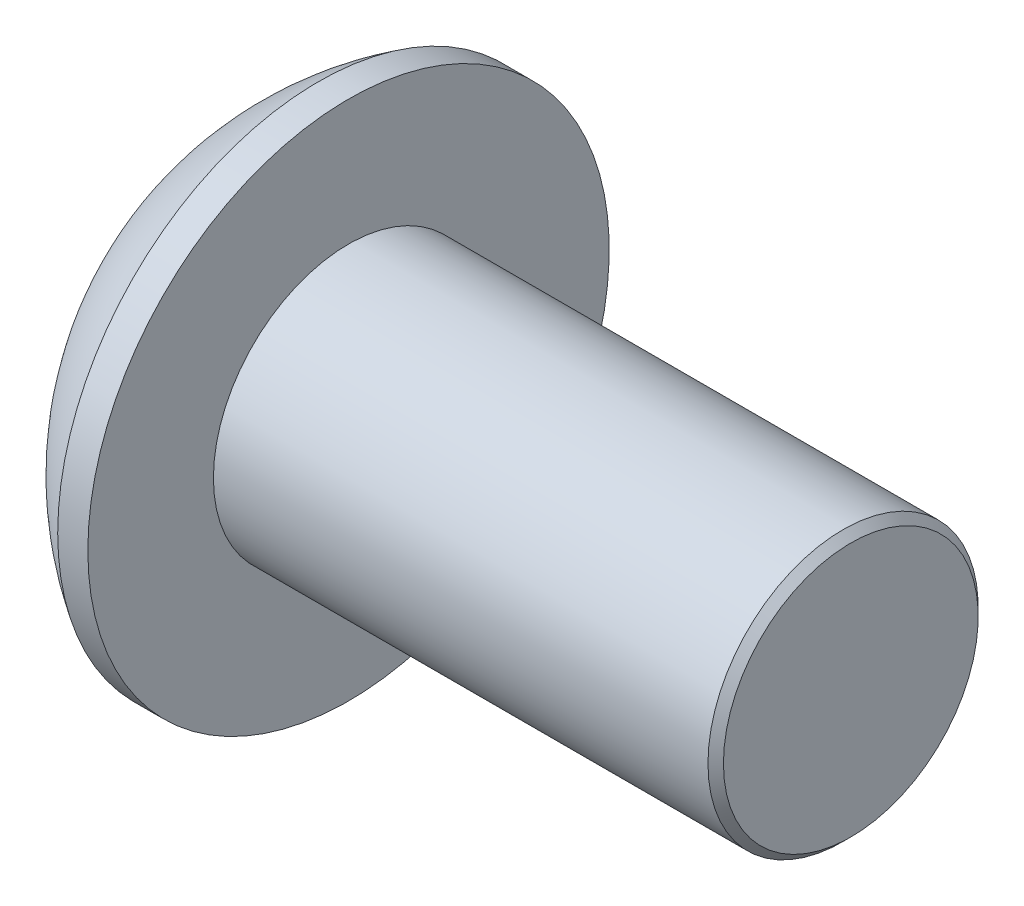
ISO-10303-21;
HEADER;
FILE_DESCRIPTION(('STEP AP214'),'2;1');
FILE_NAME('part.step','',(''),(''),'','','');
FILE_SCHEMA(('AUTOMOTIVE_DESIGN { 1 0 10303 214 1 1 1 1 }'));
ENDSEC;
DATA;
#1=APPLICATION_CONTEXT('core data for automotive mechanical design processes');
#2=APPLICATION_PROTOCOL_DEFINITION('international standard','automotive_design',2000,#1);
#3=PRODUCT_CONTEXT('',#1,'mechanical');
#4=PRODUCT('Part','Part','',(#3));
#5=PRODUCT_RELATED_PRODUCT_CATEGORY('part','',(#4));
#6=PRODUCT_DEFINITION_FORMATION('','',#4);
#7=PRODUCT_DEFINITION_CONTEXT('part definition',#1,'design');
#8=PRODUCT_DEFINITION('design','',#6,#7);
#9=PRODUCT_DEFINITION_SHAPE('','',#8);
#10=(LENGTH_UNIT() NAMED_UNIT(*) SI_UNIT(.MILLI.,.METRE.));
#11=(NAMED_UNIT(*) PLANE_ANGLE_UNIT() SI_UNIT($,.RADIAN.));
#12=(NAMED_UNIT(*) SI_UNIT($,.STERADIAN.) SOLID_ANGLE_UNIT());
#13=UNCERTAINTY_MEASURE_WITH_UNIT(LENGTH_MEASURE(1.E-05),#10,'distance_accuracy_value','');
#14=(GEOMETRIC_REPRESENTATION_CONTEXT(3) GLOBAL_UNCERTAINTY_ASSIGNED_CONTEXT((#13)) GLOBAL_UNIT_ASSIGNED_CONTEXT((#10,
#11,#12)) REPRESENTATION_CONTEXT('',''));
#15=CARTESIAN_POINT('',(0.,0.,0.));
#16=DIRECTION('',(0.,0.,1.));
#17=DIRECTION('',(1.,0.,0.));
#18=AXIS2_PLACEMENT_3D('',#15,#16,#17);
#19=CARTESIAN_POINT('',(1.32079999432833,0.,0.));
#20=DIRECTION('',(-1.,0.,0.));
#21=DIRECTION('',(0.,0.,1.));
#22=AXIS2_PLACEMENT_3D('',#19,#20,#21);
#23=CONICAL_SURFACE('',#22,1.19379999672553,1.04719755119985);
#24=CARTESIAN_POINT('',(2.01004074379096,0.,-4.44089209850063E-13));
#25=VERTEX_POINT('',#24);
#26=VERTEX_LOOP('',#25);
#27=FACE_BOUND('',#26,.T.);
#28=CARTESIAN_POINT('',(1.3207999943284,0.,0.));
#29=DIRECTION('',(-1.,0.,0.));
#30=DIRECTION('',(0.,0.,1.));
#31=AXIS2_PLACEMENT_3D('',#28,#29,#30);
#32=CIRCLE('',#31,1.19379999672553);
#33=CARTESIAN_POINT('',(1.3207999971642,0.,1.19379999836265));
#34=VERTEX_POINT('',#33);
#35=CARTESIAN_POINT('',(1.3207999971635,-1.03386112562127,0.596899999183897));
#36=VERTEX_POINT('',#35);
#37=EDGE_CURVE('E20',#34,#36,#32,.F.);
#38=ORIENTED_EDGE('',*,*,#37,.F.);
#39=CARTESIAN_POINT('',(1.32079999432935,0.,0.));
#40=DIRECTION('',(-1.,0.,0.));
#41=DIRECTION('',(0.,0.,1.));
#42=AXIS2_PLACEMENT_3D('',#39,#40,#41);
#43=CIRCLE('',#42,1.19379999672375);
#44=CARTESIAN_POINT('',(1.32079999716468,1.03386112583355,0.59689999881021));
#45=VERTEX_POINT('',#44);
#46=EDGE_CURVE('E153',#45,#34,#43,.F.);
#47=ORIENTED_EDGE('',*,*,#46,.F.);
#48=CARTESIAN_POINT('',(1.32079999432948,0.,0.));
#49=DIRECTION('',(-1.,0.,0.));
#50=DIRECTION('',(0.,0.,1.));
#51=AXIS2_PLACEMENT_3D('',#48,#49,#50);
#52=CIRCLE('',#51,1.19379999672353);
#53=CARTESIAN_POINT('',(1.32079999716474,1.03386112540457,-0.5968999995548));
#54=VERTEX_POINT('',#53);
#55=EDGE_CURVE('E460',#54,#45,#52,.F.);
#56=ORIENTED_EDGE('',*,*,#55,.F.);
#57=CARTESIAN_POINT('',(1.32079999432833,0.,0.));
#58=DIRECTION('',(-1.,0.,0.));
#59=DIRECTION('',(0.,0.,1.));
#60=AXIS2_PLACEMENT_3D('',#57,#58,#59);
#61=CIRCLE('',#60,1.19379999672553);
#62=CARTESIAN_POINT('',(1.32079999716416,0.,-1.19379999836277));
#63=VERTEX_POINT('',#62);
#64=EDGE_CURVE('E461',#63,#54,#61,.F.);
#65=ORIENTED_EDGE('',*,*,#64,.F.);
#66=CARTESIAN_POINT('',(1.32079999432699,0.,0.));
#67=DIRECTION('',(-1.,0.,0.));
#68=DIRECTION('',(0.,0.,1.));
#69=AXIS2_PLACEMENT_3D('',#66,#67,#68);
#70=CIRCLE('',#69,1.19379999672797);
#71=CARTESIAN_POINT('',(1.3207999971635,-1.03386112562049,-0.596899999183447));
#72=VERTEX_POINT('',#71);
#73=EDGE_CURVE('E463',#72,#63,#70,.F.);
#74=ORIENTED_EDGE('',*,*,#73,.F.);
#75=CARTESIAN_POINT('',(1.32079999432699,0.,0.));
#76=DIRECTION('',(-1.,0.,0.));
#77=DIRECTION('',(0.,0.,1.));
#78=AXIS2_PLACEMENT_3D('',#75,#76,#77);
#79=CIRCLE('',#78,1.19379999672797);
#80=EDGE_CURVE('E467',#36,#72,#79,.F.);
#81=ORIENTED_EDGE('',*,*,#80,.F.);
#82=EDGE_LOOP('',(#38,#47,#56,#65,#74,#81));
#83=FACE_BOUND('',#82,.T.);
#84=ADVANCED_FACE('F17',(#27,#83),#23,.F.);
#85=CARTESIAN_POINT('',(1.3208,0.,2.3876));
#86=DIRECTION('',(-1.,0.,0.));
#87=DIRECTION('',(0.,0.,1.));
#88=AXIS2_PLACEMENT_3D('',#85,#86,#87);
#89=PLANE('',#88);
#90=DIRECTION('',(0.,1.,0.));
#91=VECTOR('',#90,1.);
#92=CARTESIAN_POINT('',(1.3208,-0.689240751359,1.1938));
#93=LINE('',#92,#91);
#94=CARTESIAN_POINT('',(1.3208,-0.6892407512056,1.193800000115));
#95=VERTEX_POINT('',#94);
#96=EDGE_CURVE('E152',#34,#95,#93,.F.);
#97=ORIENTED_EDGE('',*,*,#96,.F.);
#98=ORIENTED_EDGE('',*,*,#37,.T.);
#99=DIRECTION('',(0.,0.50000000000019,0.866025403784329));
#100=VECTOR('',#99,1.);
#101=CARTESIAN_POINT('',(1.3208,-1.37848150272,0.));
#102=LINE('',#101,#100);
#103=EDGE_CURVE('E198',#95,#36,#102,.F.);
#104=ORIENTED_EDGE('',*,*,#103,.F.);
#105=EDGE_LOOP('',(#97,#98,#104));
#106=FACE_BOUND('',#105,.T.);
#107=ADVANCED_FACE('F277',(#106),#89,.T.);
#108=CARTESIAN_POINT('',(1.3208,0.,2.3876));
#109=DIRECTION('',(-1.,0.,0.));
#110=DIRECTION('',(0.,0.,1.));
#111=AXIS2_PLACEMENT_3D('',#108,#109,#110);
#112=PLANE('',#111);
#113=DIRECTION('',(0.,0.50000000000019,0.866025403784329));
#114=VECTOR('',#113,1.);
#115=CARTESIAN_POINT('',(1.3208,-1.37848150272,0.));
#116=LINE('',#115,#114);
#117=CARTESIAN_POINT('',(1.3208,-1.37848150281737,2.02535634297404E-10));
#118=VERTEX_POINT('',#117);
#119=EDGE_CURVE('E195',#36,#118,#116,.F.);
#120=ORIENTED_EDGE('',*,*,#119,.F.);
#121=ORIENTED_EDGE('',*,*,#80,.T.);
#122=DIRECTION('',(0.,-0.50000000000019,0.866025403784329));
#123=VECTOR('',#122,1.);
#124=CARTESIAN_POINT('',(1.3208,-0.689240751359,-1.1938));
#125=LINE('',#124,#123);
#126=EDGE_CURVE('E183',#118,#72,#125,.F.);
#127=ORIENTED_EDGE('',*,*,#126,.F.);
#128=EDGE_LOOP('',(#120,#121,#127));
#129=FACE_BOUND('',#128,.T.);
#130=ADVANCED_FACE('F274',(#129),#112,.T.);
#131=CARTESIAN_POINT('',(1.3208,0.,2.3876));
#132=DIRECTION('',(-1.,0.,0.));
#133=DIRECTION('',(0.,0.,1.));
#134=AXIS2_PLACEMENT_3D('',#131,#132,#133);
#135=PLANE('',#134);
#136=DIRECTION('',(0.,-0.50000000000019,0.866025403784329));
#137=VECTOR('',#136,1.);
#138=CARTESIAN_POINT('',(1.3208,-0.689240751359,-1.1938));
#139=LINE('',#138,#137);
#140=CARTESIAN_POINT('',(1.3208,-0.689240751582438,-1.19379999998452));
#141=VERTEX_POINT('',#140);
#142=EDGE_CURVE('E180',#72,#141,#139,.F.);
#143=ORIENTED_EDGE('',*,*,#142,.F.);
#144=ORIENTED_EDGE('',*,*,#73,.T.);
#145=DIRECTION('',(0.,-1.,0.));
#146=VECTOR('',#145,1.);
#147=CARTESIAN_POINT('',(1.3208,0.689240751359,-1.1938));
#148=LINE('',#147,#146);
#149=EDGE_CURVE('E169',#141,#63,#148,.F.);
#150=ORIENTED_EDGE('',*,*,#149,.F.);
#151=EDGE_LOOP('',(#143,#144,#150));
#152=FACE_BOUND('',#151,.T.);
#153=ADVANCED_FACE('F270',(#152),#135,.T.);
#154=CARTESIAN_POINT('',(1.3208,0.,2.3876));
#155=DIRECTION('',(-1.,0.,0.));
#156=DIRECTION('',(0.,0.,1.));
#157=AXIS2_PLACEMENT_3D('',#154,#155,#156);
#158=PLANE('',#157);
#159=DIRECTION('',(0.,-1.,0.));
#160=VECTOR('',#159,1.);
#161=CARTESIAN_POINT('',(1.3208,0.689240751359,-1.1938));
#162=LINE('',#161,#160);
#163=CARTESIAN_POINT('',(1.3208,0.689240751304142,-1.19380000008397));
#164=VERTEX_POINT('',#163);
#165=EDGE_CURVE('E166',#63,#164,#162,.F.);
#166=ORIENTED_EDGE('',*,*,#165,.F.);
#167=ORIENTED_EDGE('',*,*,#64,.T.);
#168=DIRECTION('',(0.,-0.50000000000019,-0.866025403784329));
#169=VECTOR('',#168,1.);
#170=CARTESIAN_POINT('',(1.3208,1.37848150272,0.));
#171=LINE('',#170,#169);
#172=EDGE_CURVE('E157',#164,#54,#171,.F.);
#173=ORIENTED_EDGE('',*,*,#172,.F.);
#174=EDGE_LOOP('',(#166,#167,#173));
#175=FACE_BOUND('',#174,.T.);
#176=ADVANCED_FACE('F266',(#175),#158,.T.);
#177=CARTESIAN_POINT('',(1.3208,0.,2.3876));
#178=DIRECTION('',(-1.,0.,0.));
#179=DIRECTION('',(0.,0.,1.));
#180=AXIS2_PLACEMENT_3D('',#177,#178,#179);
#181=PLANE('',#180);
#182=DIRECTION('',(0.,-0.50000000000019,-0.866025403784329));
#183=VECTOR('',#182,1.);
#184=CARTESIAN_POINT('',(1.3208,1.37848150272,0.));
#185=LINE('',#184,#183);
#186=CARTESIAN_POINT('',(1.3208,1.37848150281737,-2.02535824126702E-10));
#187=VERTEX_POINT('',#186);
#188=EDGE_CURVE('E108',#54,#187,#185,.F.);
#189=ORIENTED_EDGE('',*,*,#188,.F.);
#190=ORIENTED_EDGE('',*,*,#55,.T.);
#191=DIRECTION('',(0.,0.50000000000019,-0.866025403784329));
#192=VECTOR('',#191,1.);
#193=CARTESIAN_POINT('',(1.3208,0.689240751359,1.1938));
#194=LINE('',#193,#192);
#195=EDGE_CURVE('E137',#187,#45,#194,.F.);
#196=ORIENTED_EDGE('',*,*,#195,.F.);
#197=EDGE_LOOP('',(#189,#190,#196));
#198=FACE_BOUND('',#197,.T.);
#199=ADVANCED_FACE('F262',(#198),#181,.T.);
#200=CARTESIAN_POINT('',(1.3208,0.,2.3876));
#201=DIRECTION('',(-1.,0.,0.));
#202=DIRECTION('',(0.,0.,1.));
#203=AXIS2_PLACEMENT_3D('',#200,#201,#202);
#204=PLANE('',#203);
#205=DIRECTION('',(0.,0.50000000000019,-0.866025403784329));
#206=VECTOR('',#205,1.);
#207=CARTESIAN_POINT('',(1.3208,0.689240751359,1.1938));
#208=LINE('',#207,#206);
#209=CARTESIAN_POINT('',(1.3208,0.689240751385812,1.19379999996904));
#210=VERTEX_POINT('',#209);
#211=EDGE_CURVE('E139',#45,#210,#208,.F.);
#212=ORIENTED_EDGE('',*,*,#211,.F.);
#213=ORIENTED_EDGE('',*,*,#46,.T.);
#214=DIRECTION('',(0.,1.,0.));
#215=VECTOR('',#214,1.);
#216=CARTESIAN_POINT('',(1.3208,-0.689240751359,1.1938));
#217=LINE('',#216,#215);
#218=EDGE_CURVE('E149',#210,#34,#217,.F.);
#219=ORIENTED_EDGE('',*,*,#218,.F.);
#220=EDGE_LOOP('',(#212,#213,#219));
#221=FACE_BOUND('',#220,.T.);
#222=ADVANCED_FACE('F258',(#221),#204,.T.);
#223=CARTESIAN_POINT('',(1.3208,-0.689240751359,1.1938));
#224=DIRECTION('',(0.,0.,-1.));
#225=DIRECTION('',(0.,1.,0.));
#226=AXIS2_PLACEMENT_3D('',#223,#224,#225);
#227=PLANE('',#226);
#228=DIRECTION('',(0.,1.,0.));
#229=VECTOR('',#228,1.);
#230=CARTESIAN_POINT('',(0.,0.,1.19380000047));
#231=LINE('',#230,#229);
#232=CARTESIAN_POINT('',(0.,0.68924075168075,1.1938000001175));
#233=VERTEX_POINT('',#232);
#234=CARTESIAN_POINT('',(0.,-0.689240751227573,1.19380000015941));
#235=VERTEX_POINT('',#234);
#236=EDGE_CURVE('E111',#233,#235,#231,.F.);
#237=ORIENTED_EDGE('',*,*,#236,.F.);
#238=DIRECTION('',(1.,0.,0.));
#239=VECTOR('',#238,1.);
#240=CARTESIAN_POINT('',(1.3208,0.689240751359,1.1938));
#241=LINE('',#240,#239);
#242=EDGE_CURVE('E112',#210,#233,#241,.F.);
#243=ORIENTED_EDGE('',*,*,#242,.F.);
#244=ORIENTED_EDGE('',*,*,#218,.T.);
#245=ORIENTED_EDGE('',*,*,#96,.T.);
#246=DIRECTION('',(1.,0.,0.));
#247=VECTOR('',#246,1.);
#248=CARTESIAN_POINT('',(1.3208,-0.689240751264291,1.19380000016764));
#249=LINE('',#248,#247);
#250=EDGE_CURVE('E192',#235,#95,#249,.T.);
#251=ORIENTED_EDGE('',*,*,#250,.F.);
#252=EDGE_LOOP('',(#237,#243,#244,#245,#251));
#253=FACE_BOUND('',#252,.T.);
#254=ADVANCED_FACE('F254',(#253),#227,.T.);
#255=CARTESIAN_POINT('',(1.3208,-1.37848150272,0.));
#256=DIRECTION('',(0.,0.866025403784329,-0.50000000000019));
#257=DIRECTION('',(0.,0.50000000000019,0.866025403784329));
#258=AXIS2_PLACEMENT_3D('',#255,#256,#257);
#259=PLANE('',#258);
#260=DIRECTION('',(0.,-0.500000000088179,-0.866025403733529));
#261=VECTOR('',#260,1.);
#262=CARTESIAN_POINT('',(0.,-0.689240751788,1.19380000047));
#263=LINE('',#262,#261);
#264=CARTESIAN_POINT('',(0.,-1.37848150298836,9.33224186458045E-11));
#265=VERTEX_POINT('',#264);
#266=EDGE_CURVE('E133',#235,#265,#263,.T.);
#267=ORIENTED_EDGE('',*,*,#266,.F.);
#268=ORIENTED_EDGE('',*,*,#250,.T.);
#269=ORIENTED_EDGE('',*,*,#103,.T.);
#270=ORIENTED_EDGE('',*,*,#119,.T.);
#271=DIRECTION('',(1.,0.,0.));
#272=VECTOR('',#271,1.);
#273=CARTESIAN_POINT('',(1.3208,-1.37848150293344,3.73289723784587E-10));
#274=LINE('',#273,#272);
#275=EDGE_CURVE('E177',#265,#118,#274,.T.);
#276=ORIENTED_EDGE('',*,*,#275,.F.);
#277=EDGE_LOOP('',(#267,#268,#269,#270,#276));
#278=FACE_BOUND('',#277,.T.);
#279=ADVANCED_FACE('F250',(#278),#259,.T.);
#280=CARTESIAN_POINT('',(1.3208,-0.689240751359,-1.1938));
#281=DIRECTION('',(0.,0.866025403784329,0.50000000000019));
#282=DIRECTION('',(0.,-0.50000000000019,0.866025403784329));
#283=AXIS2_PLACEMENT_3D('',#280,#281,#282);
#284=PLANE('',#283);
#285=DIRECTION('',(0.,0.500000000088179,-0.866025403733529));
#286=VECTOR('',#285,1.);
#287=CARTESIAN_POINT('',(0.,-1.37848150358,0.));
#288=LINE('',#287,#286);
#289=CARTESIAN_POINT('',(0.,-0.6892407515735,-1.1938000001175));
#290=VERTEX_POINT('',#289);
#291=EDGE_CURVE('E128',#265,#290,#288,.T.);
#292=ORIENTED_EDGE('',*,*,#291,.F.);
#293=ORIENTED_EDGE('',*,*,#275,.T.);
#294=ORIENTED_EDGE('',*,*,#126,.T.);
#295=ORIENTED_EDGE('',*,*,#142,.T.);
#296=DIRECTION('',(1.,0.,0.));
#297=VECTOR('',#296,1.);
#298=CARTESIAN_POINT('',(1.3208,-0.689240751788,-1.1938));
#299=LINE('',#298,#297);
#300=EDGE_CURVE('E163',#290,#141,#299,.T.);
#301=ORIENTED_EDGE('',*,*,#300,.F.);
#302=EDGE_LOOP('',(#292,#293,#294,#295,#301));
#303=FACE_BOUND('',#302,.T.);
#304=ADVANCED_FACE('F246',(#303),#284,.T.);
#305=CARTESIAN_POINT('',(1.3208,0.689240751359,-1.1938));
#306=DIRECTION('',(0.,0.,1.));
#307=DIRECTION('',(0.,-1.,0.));
#308=AXIS2_PLACEMENT_3D('',#305,#306,#307);
#309=PLANE('',#308);
#310=DIRECTION('',(0.,1.,0.));
#311=VECTOR('',#310,1.);
#312=CARTESIAN_POINT('',(0.,0.,-1.19380000047));
#313=LINE('',#312,#311);
#314=CARTESIAN_POINT('',(0.,0.689240751442573,-1.19380000015941));
#315=VERTEX_POINT('',#314);
#316=EDGE_CURVE('E126',#290,#315,#313,.T.);
#317=ORIENTED_EDGE('',*,*,#316,.F.);
#318=ORIENTED_EDGE('',*,*,#300,.T.);
#319=ORIENTED_EDGE('',*,*,#149,.T.);
#320=ORIENTED_EDGE('',*,*,#165,.T.);
#321=DIRECTION('',(1.,0.,0.));
#322=VECTOR('',#321,1.);
#323=CARTESIAN_POINT('',(1.3208,0.689240751264291,-1.19380000016764));
#324=LINE('',#323,#322);
#325=EDGE_CURVE('E140',#315,#164,#324,.T.);
#326=ORIENTED_EDGE('',*,*,#325,.F.);
#327=EDGE_LOOP('',(#317,#318,#319,#320,#326));
#328=FACE_BOUND('',#327,.T.);
#329=ADVANCED_FACE('F243',(#328),#309,.T.);
#330=CARTESIAN_POINT('',(1.3208,1.37848150272,0.));
#331=DIRECTION('',(0.,-0.866025403784329,0.50000000000019));
#332=DIRECTION('',(0.,-0.50000000000019,-0.866025403784329));
#333=AXIS2_PLACEMENT_3D('',#330,#331,#332);
#334=PLANE('',#333);
#335=DIRECTION('',(0.,0.500000000088179,0.866025403733529));
#336=VECTOR('',#335,1.);
#337=CARTESIAN_POINT('',(0.,0.689240751788,-1.19380000047));
#338=LINE('',#337,#336);
#339=CARTESIAN_POINT('',(0.,1.37848150298836,-9.33226360497484E-11));
#340=VERTEX_POINT('',#339);
#341=EDGE_CURVE('E104',#315,#340,#338,.T.);
#342=ORIENTED_EDGE('',*,*,#341,.F.);
#343=ORIENTED_EDGE('',*,*,#325,.T.);
#344=ORIENTED_EDGE('',*,*,#172,.T.);
#345=ORIENTED_EDGE('',*,*,#188,.T.);
#346=DIRECTION('',(1.,0.,0.));
#347=VECTOR('',#346,1.);
#348=CARTESIAN_POINT('',(1.3208,1.37848150293344,-3.73289723784587E-10));
#349=LINE('',#348,#347);
#350=EDGE_CURVE('E99',#340,#187,#349,.T.);
#351=ORIENTED_EDGE('',*,*,#350,.F.);
#352=EDGE_LOOP('',(#342,#343,#344,#345,#351));
#353=FACE_BOUND('',#352,.T.);
#354=ADVANCED_FACE('F101',(#353),#334,.T.);
#355=CARTESIAN_POINT('',(1.3208,0.689240751359,1.1938));
#356=DIRECTION('',(0.,-0.866025403784329,-0.50000000000019));
#357=DIRECTION('',(0.,0.50000000000019,-0.866025403784329));
#358=AXIS2_PLACEMENT_3D('',#355,#356,#357);
#359=PLANE('',#358);
#360=DIRECTION('',(0.,-0.500000000088179,0.866025403733529));
#361=VECTOR('',#360,1.);
#362=CARTESIAN_POINT('',(0.,1.37848150358,0.));
#363=LINE('',#362,#361);
#364=EDGE_CURVE('E116',#340,#233,#363,.T.);
#365=ORIENTED_EDGE('',*,*,#364,.F.);
#366=ORIENTED_EDGE('',*,*,#350,.T.);
#367=ORIENTED_EDGE('',*,*,#195,.T.);
#368=ORIENTED_EDGE('',*,*,#211,.T.);
#369=ORIENTED_EDGE('',*,*,#242,.T.);
#370=EDGE_LOOP('',(#365,#366,#367,#368,#369));
#371=FACE_BOUND('',#370,.T.);
#372=ADVANCED_FACE('F117',(#371),#359,.T.);
#373=CARTESIAN_POINT('',(0.,0.,0.));
#374=DIRECTION('',(-1.,0.,0.));
#375=DIRECTION('',(0.,0.,1.));
#376=AXIS2_PLACEMENT_3D('',#373,#374,#375);
#377=PLANE('',#376);
#378=ORIENTED_EDGE('',*,*,#341,.T.);
#379=ORIENTED_EDGE('',*,*,#364,.T.);
#380=ORIENTED_EDGE('',*,*,#236,.T.);
#381=ORIENTED_EDGE('',*,*,#266,.T.);
#382=ORIENTED_EDGE('',*,*,#291,.T.);
#383=ORIENTED_EDGE('',*,*,#316,.T.);
#384=EDGE_LOOP('',(#378,#379,#380,#381,#382,#383));
#385=FACE_BOUND('',#384,.T.);
#386=CARTESIAN_POINT('',(0.,0.,1.64782500000536));
#387=CARTESIAN_POINT('',(0.,-0.04635989552049,1.64782546257097));
#388=CARTESIAN_POINT('',(0.,-0.0926992488683555,1.64586763073081));
#389=CARTESIAN_POINT('',(0.,-0.185043879083177,1.63805801965021));
#390=CARTESIAN_POINT('',(0.,-0.231049189468976,1.63220663671495));
#391=CARTESIAN_POINT('',(0.,-0.367996036986794,1.60886985147167));
#392=CARTESIAN_POINT('',(0.,-0.458015157975244,1.58560165502935));
#393=CARTESIAN_POINT('',(0.,-0.632905632898329,1.52425376809873));
#394=CARTESIAN_POINT('',(0.,-0.717774480110067,1.48616693092073));
#395=CARTESIAN_POINT('',(0.,-0.839287028243353,1.41882881149843));
#396=CARTESIAN_POINT('',(0.,-0.878829194908413,1.39467898274249));
#397=CARTESIAN_POINT('',(0.,-0.955779903188491,1.34311545470858));
#398=CARTESIAN_POINT('',(0.,-0.993186364031593,1.31569865012388));
#399=CARTESIAN_POINT('',(0.,-1.10169087735076,1.22888873855313));
#400=CARTESIAN_POINT('',(0.,-1.16917572609218,1.164879663632));
#401=CARTESIAN_POINT('',(0.,-1.29242370652351,1.02642979783264));
#402=CARTESIAN_POINT('',(0.,-1.34818702288942,0.951989171337199));
#403=CARTESIAN_POINT('',(0.,-1.42186522783433,0.834136421122725));
#404=CARTESIAN_POINT('',(0.,-1.44478071182158,0.793778440815458));
#405=CARTESIAN_POINT('',(0.,-1.4871123391999,0.711316924539943));
#406=CARTESIAN_POINT('',(0.,-1.50653157559602,0.669214972372495));
#407=CARTESIAN_POINT('',(0.,-1.55932123628557,0.540731094440466));
#408=CARTESIAN_POINT('',(0.,-1.58730351324463,0.452043084039958));
#409=CARTESIAN_POINT('',(0.,-1.62098462858084,0.302403860883362));
#410=CARTESIAN_POINT('',(0.,-1.63103510187072,0.242378378790916));
#411=CARTESIAN_POINT('',(0.,-1.64445650400804,0.121577198568298));
#412=CARTESIAN_POINT('',(0.,-1.64782729248849,0.0608014846997471));
#413=CARTESIAN_POINT('',(0.,-1.64782150975628,-0.0925687629421743));
#414=CARTESIAN_POINT('',(-1.9333735995594E-13,-1.63999944972072,-0.18519726089941));
#415=CARTESIAN_POINT('',(1.93547530418572E-13,-1.60890756135732,-0.367896025643765));
#416=CARTESIAN_POINT('',(7.32790303467997E-13,-1.58562094952986,-0.45796340200462));
#417=CARTESIAN_POINT('',(6.50114150250784E-13,-1.52426274082872,-0.632876806119466));
#418=CARTESIAN_POINT('',(0.,-1.48619763326635,-0.717725106678358));
#419=CARTESIAN_POINT('',(0.,-1.39637084329153,-0.879806708477382));
#420=CARTESIAN_POINT('',(5.35061032227965E-13,-1.3446120217873,-0.957041595700684));
#421=CARTESIAN_POINT('',(6.34416925134163E-13,-1.22886033694569,-1.10173205418469));
#422=CARTESIAN_POINT('',(1.6994538905624E-13,-1.16486666506414,-1.16918697861497));
#423=CARTESIAN_POINT('',(-1.69958403260065E-13,-1.02645562147194,-1.2924010370728));
#424=CARTESIAN_POINT('',(0.,-0.952037451902772,-1.34815927505588));
#425=CARTESIAN_POINT('',(0.,-0.794887505692453,-1.44640010291947));
#426=CARTESIAN_POINT('',(0.,-0.7121539059956,-1.48887977321063));
#427=CARTESIAN_POINT('',(0.,-0.540739575913136,-1.55932738119548));
#428=CARTESIAN_POINT('',(0.,-0.452061935646679,-1.58730279412514));
#429=CARTESIAN_POINT('',(0.,-0.302365838722702,-1.62099087096933));
#430=CARTESIAN_POINT('',(0.,-0.242289109076418,-1.63104800673718));
#431=CARTESIAN_POINT('',(0.,-0.121483277884958,-1.64446394827614));
#432=CARTESIAN_POINT('',(0.,-0.0607552831143619,-1.64783272317073));
#433=CARTESIAN_POINT('',(0.,0.,-1.64782500000536));
#434=B_SPLINE_CURVE_WITH_KNOTS('',3,(#386,#387,#388,#389,#390,#391,#392,#393,#394,#395,#396,
#397,#398,#399,#400,#401,#402,#403,#404,#405,#406,#407,#408,#409,#410,#411,#412,#413,#414,#415,
#416,#417,#418,#419,#420,#421,#422,#423,#424,#425,#426,#427,#428,#429,#430,#431,#432,#433),
.UNSPECIFIED.,.F.,.F.,(4,2,2,2,2,2,2,2,2,2,2,2,2,2,2,2,2,2,2,2,2,2,2,4),(0.,0.138997594551207,
0.277981043393208,0.555513590217001,0.833180150849271,0.972036959292317,1.11102682201745,
1.388662142426,1.66629308828505,1.80537608011522,1.94433541904879,2.22180684171081,
2.4040603524114,2.58631769294946,2.86380000500242,3.14158395863107,3.41924607364308,
3.69685022487674,3.97447272801874,4.25211649114233,4.52982125757117,4.80738275727795,
4.98977421398674,5.17189360820584),.UNSPECIFIED.);
#435=CARTESIAN_POINT('',(0.,0.,1.64782500000536));
#436=VERTEX_POINT('',#435);
#437=CARTESIAN_POINT('',(0.,0.,-1.64782500000536));
#438=VERTEX_POINT('',#437);
#439=EDGE_CURVE('E34',#436,#438,#434,.T.);
#440=ORIENTED_EDGE('',*,*,#439,.F.);
#441=CARTESIAN_POINT('',(0.,0.,0.));
#442=DIRECTION('',(-1.,0.,0.));
#443=DIRECTION('',(0.,-1.,0.));
#444=AXIS2_PLACEMENT_3D('',#441,#442,#443);
#445=CIRCLE('',#444,1.64782500000537);
#446=EDGE_CURVE('E224',#438,#436,#445,.F.);
#447=ORIENTED_EDGE('',*,*,#446,.F.);
#448=EDGE_LOOP('',(#440,#447));
#449=FACE_BOUND('',#448,.T.);
#450=ADVANCED_FACE('F123',(#385,#449),#377,.T.);
#451=CARTESIAN_POINT('',(3.50132362608,0.,0.));
#452=DIRECTION('',(-1.,0.,0.));
#453=DIRECTION('',(0.,1.,0.));
#454=AXIS2_PLACEMENT_3D('',#451,#452,#453);
#455=SPHERICAL_SURFACE('',#454,3.8697021029);
#456=ORIENTED_EDGE('',*,*,#446,.T.);
#457=ORIENTED_EDGE('',*,*,#439,.T.);
#458=EDGE_LOOP('',(#456,#457));
#459=FACE_BOUND('',#458,.T.);
#460=CARTESIAN_POINT('',(1.47320000082,0.,0.));
#461=DIRECTION('',(-1.,0.,0.));
#462=DIRECTION('',(0.,0.,1.));
#463=AXIS2_PLACEMENT_3D('',#460,#461,#462);
#464=CIRCLE('',#463,3.29565);
#465=CARTESIAN_POINT('',(1.47320000082,0.,3.29565));
#466=VERTEX_POINT('',#465);
#467=EDGE_CURVE('E223',#466,#466,#464,.F.);
#468=ORIENTED_EDGE('',*,*,#467,.F.);
#469=EDGE_LOOP('',(#468));
#470=FACE_BOUND('',#469,.T.);
#471=ADVANCED_FACE('F238',(#459,#470),#455,.T.);
#472=CARTESIAN_POINT('',(8.2042,0.,0.));
#473=DIRECTION('',(-1.,0.,0.));
#474=DIRECTION('',(0.,0.,1.));
#475=AXIS2_PLACEMENT_3D('',#472,#473,#474);
#476=PLANE('',#475);
#477=CARTESIAN_POINT('',(8.20419999996602,0.,0.));
#478=DIRECTION('',(-1.,0.,0.));
#479=DIRECTION('',(0.,0.,1.));
#480=AXIS2_PLACEMENT_3D('',#477,#478,#479);
#481=CIRCLE('',#480,1.61036000008608);
#482=CARTESIAN_POINT('',(8.20419999996602,0.,1.61036000008608));
#483=VERTEX_POINT('',#482);
#484=EDGE_CURVE('E220',#483,#483,#481,.T.);
#485=ORIENTED_EDGE('',*,*,#484,.F.);
#486=EDGE_LOOP('',(#485));
#487=FACE_BOUND('',#486,.T.);
#488=ADVANCED_FACE('F305',(#487),#476,.F.);
#489=CARTESIAN_POINT('',(0.,0.,0.));
#490=DIRECTION('',(-1.,0.,0.));
#491=DIRECTION('',(0.,0.,1.));
#492=AXIS2_PLACEMENT_3D('',#489,#490,#491);
#493=CYLINDRICAL_SURFACE('',#492,3.29565);
#494=ORIENTED_EDGE('',*,*,#467,.T.);
#495=EDGE_LOOP('',(#494));
#496=FACE_BOUND('',#495,.T.);
#497=CARTESIAN_POINT('',(1.85419999994,0.,0.));
#498=DIRECTION('',(-1.,0.,0.));
#499=DIRECTION('',(0.,0.,1.));
#500=AXIS2_PLACEMENT_3D('',#497,#498,#499);
#501=CIRCLE('',#500,3.29565);
#502=CARTESIAN_POINT('',(1.85419999994,0.,3.29565));
#503=VERTEX_POINT('',#502);
#504=EDGE_CURVE('E217',#503,#503,#501,.T.);
#505=ORIENTED_EDGE('',*,*,#504,.T.);
#506=EDGE_LOOP('',(#505));
#507=FACE_BOUND('',#506,.T.);
#508=ADVANCED_FACE('F301',(#496,#507),#493,.T.);
#509=CARTESIAN_POINT('',(8.10641000009582,0.,0.));
#510=DIRECTION('',(-1.,0.,0.));
#511=DIRECTION('',(0.,0.,1.));
#512=AXIS2_PLACEMENT_3D('',#509,#510,#511);
#513=CONICAL_SURFACE('',#512,1.70814999995628,0.785398163397448);
#514=CARTESIAN_POINT('',(8.10641,0.,0.));
#515=DIRECTION('',(-1.,0.,0.));
#516=DIRECTION('',(0.,0.,1.));
#517=AXIS2_PLACEMENT_3D('',#514,#515,#516);
#518=CIRCLE('',#517,1.70815);
#519=CARTESIAN_POINT('',(8.10641,0.,1.70815));
#520=VERTEX_POINT('',#519);
#521=EDGE_CURVE('E26',#520,#520,#518,.T.);
#522=ORIENTED_EDGE('',*,*,#521,.F.);
#523=EDGE_LOOP('',(#522));
#524=FACE_BOUND('',#523,.T.);
#525=ORIENTED_EDGE('',*,*,#484,.T.);
#526=EDGE_LOOP('',(#525));
#527=FACE_BOUND('',#526,.T.);
#528=ADVANCED_FACE('F294',(#524,#527),#513,.T.);
#529=CARTESIAN_POINT('',(1.8542,1.70815,0.));
#530=DIRECTION('',(-1.,0.,0.));
#531=DIRECTION('',(0.,0.,1.));
#532=AXIS2_PLACEMENT_3D('',#529,#530,#531);
#533=PLANE('',#532);
#534=CARTESIAN_POINT('',(1.85419999994,0.,0.));
#535=DIRECTION('',(-1.,0.,0.));
#536=DIRECTION('',(0.,0.,1.));
#537=AXIS2_PLACEMENT_3D('',#534,#535,#536);
#538=CIRCLE('',#537,1.70815);
#539=CARTESIAN_POINT('',(1.85419999994,0.,1.70815));
#540=VERTEX_POINT('',#539);
#541=EDGE_CURVE('E11',#540,#540,#538,.F.);
#542=ORIENTED_EDGE('',*,*,#541,.F.);
#543=EDGE_LOOP('',(#542));
#544=FACE_BOUND('',#543,.T.);
#545=ORIENTED_EDGE('',*,*,#504,.F.);
#546=EDGE_LOOP('',(#545));
#547=FACE_BOUND('',#546,.T.);
#548=ADVANCED_FACE('F288',(#544,#547),#533,.F.);
#549=CARTESIAN_POINT('',(0.,0.,0.));
#550=DIRECTION('',(-1.,0.,0.));
#551=DIRECTION('',(0.,0.,1.));
#552=AXIS2_PLACEMENT_3D('',#549,#550,#551);
#553=CYLINDRICAL_SURFACE('',#552,1.70815);
#554=ORIENTED_EDGE('',*,*,#541,.T.);
#555=EDGE_LOOP('',(#554));
#556=FACE_BOUND('',#555,.T.);
#557=ORIENTED_EDGE('',*,*,#521,.T.);
#558=EDGE_LOOP('',(#557));
#559=FACE_BOUND('',#558,.T.);
#560=ADVANCED_FACE('F286',(#556,#559),#553,.T.);
#561=CLOSED_SHELL('',(#84,#107,#130,#153,#176,#199,#222,#254,#279,#304,#329,#354,#372,#450,#471,
#488,#508,#528,#548,#560));
#562=MANIFOLD_SOLID_BREP('B1',#561);
#563=ADVANCED_BREP_SHAPE_REPRESENTATION('',(#18,#562),#14);
#564=SHAPE_DEFINITION_REPRESENTATION(#9,#563);
ENDSEC;
END-ISO-10303-21;
